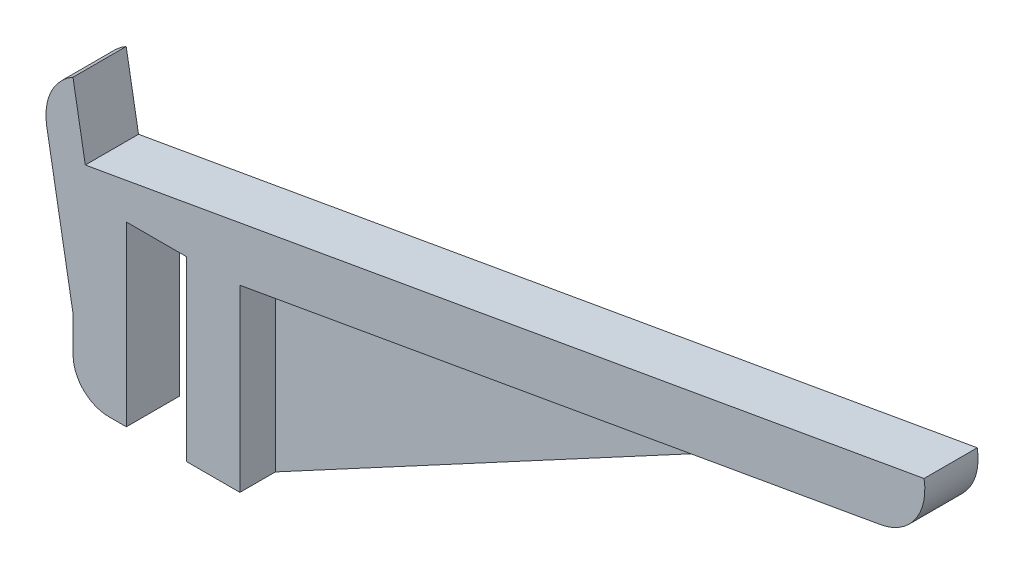
ISO-10303-21;
HEADER;
FILE_DESCRIPTION(('STEP AP214'),'2;1');
FILE_NAME('part.step','',(''),(''),'','','');
FILE_SCHEMA(('AUTOMOTIVE_DESIGN { 1 0 10303 214 1 1 1 1 }'));
ENDSEC;
DATA;
#1=APPLICATION_CONTEXT('core data for automotive mechanical design processes');
#2=APPLICATION_PROTOCOL_DEFINITION('international standard','automotive_design',2000,#1);
#3=PRODUCT_CONTEXT('',#1,'mechanical');
#4=PRODUCT('Part','Part','',(#3));
#5=PRODUCT_RELATED_PRODUCT_CATEGORY('part','',(#4));
#6=PRODUCT_DEFINITION_FORMATION('','',#4);
#7=PRODUCT_DEFINITION_CONTEXT('part definition',#1,'design');
#8=PRODUCT_DEFINITION('design','',#6,#7);
#9=PRODUCT_DEFINITION_SHAPE('','',#8);
#10=(LENGTH_UNIT() NAMED_UNIT(*) SI_UNIT(.MILLI.,.METRE.));
#11=(NAMED_UNIT(*) PLANE_ANGLE_UNIT() SI_UNIT($,.RADIAN.));
#12=(NAMED_UNIT(*) SI_UNIT($,.STERADIAN.) SOLID_ANGLE_UNIT());
#13=UNCERTAINTY_MEASURE_WITH_UNIT(LENGTH_MEASURE(1.E-05),#10,'distance_accuracy_value','');
#14=(GEOMETRIC_REPRESENTATION_CONTEXT(3) GLOBAL_UNCERTAINTY_ASSIGNED_CONTEXT((#13)) GLOBAL_UNIT_ASSIGNED_CONTEXT((#10,
#11,#12)) REPRESENTATION_CONTEXT('',''));
#15=CARTESIAN_POINT('',(0.,0.,0.));
#16=DIRECTION('',(0.,0.,1.));
#17=DIRECTION('',(1.,0.,0.));
#18=AXIS2_PLACEMENT_3D('',#15,#16,#17);
#19=CARTESIAN_POINT('',(15.,-50.,15.));
#20=DIRECTION('',(-1.,0.,0.));
#21=DIRECTION('',(0.,0.,1.));
#22=AXIS2_PLACEMENT_3D('',#19,#20,#21);
#23=PLANE('',#22);
#24=DIRECTION('',(0.,-1.,0.));
#25=VECTOR('',#24,1.);
#26=CARTESIAN_POINT('',(15.,0.5653303232422,5.));
#27=LINE('',#26,#25);
#28=CARTESIAN_POINT('',(15.,0.5653303232422,5.));
#29=VERTEX_POINT('',#28);
#30=CARTESIAN_POINT('',(15.,-50.,5.));
#31=VERTEX_POINT('',#30);
#32=EDGE_CURVE('E166',#29,#31,#27,.T.);
#33=ORIENTED_EDGE('',*,*,#32,.F.);
#34=DIRECTION('',(0.,0.,-1.));
#35=VECTOR('',#34,1.);
#36=CARTESIAN_POINT('',(15.,0.5653303232422,15.));
#37=LINE('',#36,#35);
#38=CARTESIAN_POINT('',(15.,0.5653303232422,15.));
#39=VERTEX_POINT('',#38);
#40=EDGE_CURVE('E236',#39,#29,#37,.T.);
#41=ORIENTED_EDGE('',*,*,#40,.F.);
#42=DIRECTION('',(0.,1.,0.));
#43=VECTOR('',#42,1.);
#44=CARTESIAN_POINT('',(15.,-50.,15.));
#45=LINE('',#44,#43);
#46=CARTESIAN_POINT('',(15.,-50.,15.));
#47=VERTEX_POINT('',#46);
#48=EDGE_CURVE('E184',#47,#39,#45,.T.);
#49=ORIENTED_EDGE('',*,*,#48,.F.);
#50=DIRECTION('',(0.,0.,-1.));
#51=VECTOR('',#50,1.);
#52=CARTESIAN_POINT('',(15.,-50.,15.));
#53=LINE('',#52,#51);
#54=EDGE_CURVE('E238',#47,#31,#53,.T.);
#55=ORIENTED_EDGE('',*,*,#54,.T.);
#56=EDGE_LOOP('',(#33,#41,#49,#55));
#57=FACE_BOUND('',#56,.T.);
#58=ADVANCED_FACE('F37',(#57),#23,.F.);
#59=CARTESIAN_POINT('',(15.,0.5653303232422,15.));
#60=DIRECTION('',(-0.173648177666932,0.984807753012208,0.));
#61=DIRECTION('',(-0.984807753012208,-0.173648177666932,0.));
#62=AXIS2_PLACEMENT_3D('',#59,#60,#61);
#63=PLANE('',#62);
#64=DIRECTION('',(0.984807753012208,0.173648177666932,0.));
#65=VECTOR('',#64,1.);
#66=CARTESIAN_POINT('',(15.,0.5653303232422,0.));
#67=LINE('',#66,#65);
#68=CARTESIAN_POINT('',(154.906481174219,25.2346177302382,0.));
#69=VERTEX_POINT('',#68);
#70=CARTESIAN_POINT('',(195.620066040424,32.413521223514,0.));
#71=VERTEX_POINT('',#70);
#72=EDGE_CURVE('E144',#69,#71,#67,.T.);
#73=ORIENTED_EDGE('',*,*,#72,.T.);
#74=DIRECTION('',(0.,0.,-1.));
#75=VECTOR('',#74,1.);
#76=CARTESIAN_POINT('',(195.620066040424,32.413521223514,15.));
#77=LINE('',#76,#75);
#78=CARTESIAN_POINT('',(195.620066040424,32.413521223514,15.));
#79=VERTEX_POINT('',#78);
#80=EDGE_CURVE('E45',#71,#79,#77,.F.);
#81=ORIENTED_EDGE('',*,*,#80,.T.);
#82=DIRECTION('',(0.984807753012208,0.173648177666932,0.));
#83=VECTOR('',#82,1.);
#84=CARTESIAN_POINT('',(15.,0.5653303232422,15.));
#85=LINE('',#84,#83);
#86=EDGE_CURVE('E186',#39,#79,#85,.T.);
#87=ORIENTED_EDGE('',*,*,#86,.F.);
#88=ORIENTED_EDGE('',*,*,#40,.T.);
#89=DIRECTION('',(-0.984807753012208,-0.173648177666932,0.));
#90=VECTOR('',#89,1.);
#91=CARTESIAN_POINT('',(154.906481174219,25.2346177302382,5.));
#92=LINE('',#91,#90);
#93=CARTESIAN_POINT('',(154.906481174219,25.2346177302382,5.));
#94=VERTEX_POINT('',#93);
#95=EDGE_CURVE('E159',#94,#29,#92,.T.);
#96=ORIENTED_EDGE('',*,*,#95,.F.);
#97=DIRECTION('',(0.,0.,-1.));
#98=VECTOR('',#97,1.);
#99=CARTESIAN_POINT('',(154.906481174219,25.2346177302382,5.));
#100=LINE('',#99,#98);
#101=EDGE_CURVE('E155',#94,#69,#100,.T.);
#102=ORIENTED_EDGE('',*,*,#101,.T.);
#103=EDGE_LOOP('',(#73,#81,#87,#88,#96,#102));
#104=FACE_BOUND('',#103,.T.);
#105=ADVANCED_FACE('F156',(#104),#63,.F.);
#106=CARTESIAN_POINT('',(0.,0.,15.));
#107=DIRECTION('',(0.,1.,0.));
#108=DIRECTION('',(0.,0.,1.));
#109=AXIS2_PLACEMENT_3D('',#106,#107,#108);
#110=PLANE('',#109);
#111=DIRECTION('',(1.,0.,0.));
#112=VECTOR('',#111,1.);
#113=CARTESIAN_POINT('',(0.,0.,0.));
#114=LINE('',#113,#112);
#115=CARTESIAN_POINT('',(-17.,0.,0.));
#116=VERTEX_POINT('',#115);
#117=CARTESIAN_POINT('',(0.,0.,0.));
#118=VERTEX_POINT('',#117);
#119=EDGE_CURVE('E175',#116,#118,#114,.T.);
#120=ORIENTED_EDGE('',*,*,#119,.T.);
#121=DIRECTION('',(0.,0.,-1.));
#122=VECTOR('',#121,1.);
#123=CARTESIAN_POINT('',(0.,0.,15.));
#124=LINE('',#123,#122);
#125=CARTESIAN_POINT('',(0.,0.,15.));
#126=VERTEX_POINT('',#125);
#127=EDGE_CURVE('E244',#126,#118,#124,.T.);
#128=ORIENTED_EDGE('',*,*,#127,.F.);
#129=DIRECTION('',(1.,0.,0.));
#130=VECTOR('',#129,1.);
#131=CARTESIAN_POINT('',(0.,0.,15.));
#132=LINE('',#131,#130);
#133=CARTESIAN_POINT('',(-17.,0.,15.));
#134=VERTEX_POINT('',#133);
#135=EDGE_CURVE('E176',#134,#126,#132,.T.);
#136=ORIENTED_EDGE('',*,*,#135,.F.);
#137=DIRECTION('',(0.,0.,-1.));
#138=VECTOR('',#137,1.);
#139=CARTESIAN_POINT('',(-17.,0.,15.));
#140=LINE('',#139,#138);
#141=EDGE_CURVE('E201',#134,#116,#140,.T.);
#142=ORIENTED_EDGE('',*,*,#141,.T.);
#143=EDGE_LOOP('',(#120,#128,#136,#142));
#144=FACE_BOUND('',#143,.T.);
#145=ADVANCED_FACE('F312',(#144),#110,.F.);
#146=CARTESIAN_POINT('',(0.,0.,15.));
#147=DIRECTION('',(1.,0.,0.));
#148=DIRECTION('',(0.,1.,0.));
#149=AXIS2_PLACEMENT_3D('',#146,#147,#148);
#150=PLANE('',#149);
#151=DIRECTION('',(0.,-1.,0.));
#152=VECTOR('',#151,1.);
#153=CARTESIAN_POINT('',(0.,0.,0.));
#154=LINE('',#153,#152);
#155=CARTESIAN_POINT('',(0.,-50.,0.));
#156=VERTEX_POINT('',#155);
#157=EDGE_CURVE('E204',#118,#156,#154,.T.);
#158=ORIENTED_EDGE('',*,*,#157,.T.);
#159=DIRECTION('',(0.,0.,-1.));
#160=VECTOR('',#159,1.);
#161=CARTESIAN_POINT('',(0.,-50.,15.));
#162=LINE('',#161,#160);
#163=CARTESIAN_POINT('',(0.,-50.,15.));
#164=VERTEX_POINT('',#163);
#165=EDGE_CURVE('E241',#164,#156,#162,.T.);
#166=ORIENTED_EDGE('',*,*,#165,.F.);
#167=DIRECTION('',(0.,-1.,0.));
#168=VECTOR('',#167,1.);
#169=CARTESIAN_POINT('',(0.,0.,15.));
#170=LINE('',#169,#168);
#171=EDGE_CURVE('E179',#126,#164,#170,.T.);
#172=ORIENTED_EDGE('',*,*,#171,.F.);
#173=ORIENTED_EDGE('',*,*,#127,.T.);
#174=EDGE_LOOP('',(#158,#166,#172,#173));
#175=FACE_BOUND('',#174,.T.);
#176=ADVANCED_FACE('F319',(#175),#150,.F.);
#177=CARTESIAN_POINT('',(0.,-50.,15.));
#178=DIRECTION('',(0.,1.,0.));
#179=DIRECTION('',(0.,0.,1.));
#180=AXIS2_PLACEMENT_3D('',#177,#178,#179);
#181=PLANE('',#180);
#182=DIRECTION('',(1.,0.,0.));
#183=VECTOR('',#182,1.);
#184=CARTESIAN_POINT('',(0.,-50.,0.));
#185=LINE('',#184,#183);
#186=CARTESIAN_POINT('',(15.,-50.,0.));
#187=VERTEX_POINT('',#186);
#188=EDGE_CURVE('E152',#156,#187,#185,.T.);
#189=ORIENTED_EDGE('',*,*,#188,.T.);
#190=DIRECTION('',(0.,0.,-1.));
#191=VECTOR('',#190,1.);
#192=CARTESIAN_POINT('',(15.,-50.,5.));
#193=LINE('',#192,#191);
#194=EDGE_CURVE('E163',#31,#187,#193,.T.);
#195=ORIENTED_EDGE('',*,*,#194,.F.);
#196=ORIENTED_EDGE('',*,*,#54,.F.);
#197=DIRECTION('',(1.,0.,0.));
#198=VECTOR('',#197,1.);
#199=CARTESIAN_POINT('',(0.,-50.,15.));
#200=LINE('',#199,#198);
#201=EDGE_CURVE('E182',#164,#47,#200,.T.);
#202=ORIENTED_EDGE('',*,*,#201,.F.);
#203=ORIENTED_EDGE('',*,*,#165,.T.);
#204=EDGE_LOOP('',(#189,#195,#196,#202,#203));
#205=FACE_BOUND('',#204,.T.);
#206=ADVANCED_FACE('F316',(#205),#181,.F.);
#207=CARTESIAN_POINT('',(-28.5664010523266,8.11479754363747,15.));
#208=DIRECTION('',(0.173648177666932,-0.984807753012208,0.));
#209=DIRECTION('',(0.984807753012208,0.173648177666932,0.));
#210=AXIS2_PLACEMENT_3D('',#207,#208,#209);
#211=PLANE('',#210);
#212=DIRECTION('',(-0.984807753012208,-0.173648177666932,0.));
#213=VECTOR('',#212,1.);
#214=CARTESIAN_POINT('',(-28.5664010523266,8.11479754363747,0.));
#215=LINE('',#214,#213);
#216=CARTESIAN_POINT('',(207.787459670603,49.7903601837011,0.));
#217=VERTEX_POINT('',#216);
#218=CARTESIAN_POINT('',(-28.5664010523266,8.11479754363747,0.));
#219=VERTEX_POINT('',#218);
#220=EDGE_CURVE('E151',#217,#219,#215,.T.);
#221=ORIENTED_EDGE('',*,*,#220,.T.);
#222=DIRECTION('',(0.,0.,-1.));
#223=VECTOR('',#222,1.);
#224=CARTESIAN_POINT('',(-28.5664010523266,8.11479754363747,15.));
#225=LINE('',#224,#223);
#226=CARTESIAN_POINT('',(-28.5664010523266,8.11479754363747,15.));
#227=VERTEX_POINT('',#226);
#228=EDGE_CURVE('E230',#227,#219,#225,.T.);
#229=ORIENTED_EDGE('',*,*,#228,.F.);
#230=DIRECTION('',(-0.984807753012208,-0.173648177666932,0.));
#231=VECTOR('',#230,1.);
#232=CARTESIAN_POINT('',(-28.5664010523266,8.11479754363747,15.));
#233=LINE('',#232,#231);
#234=CARTESIAN_POINT('',(207.787459670603,49.7903601837011,15.));
#235=VERTEX_POINT('',#234);
#236=EDGE_CURVE('E188',#235,#227,#233,.T.);
#237=ORIENTED_EDGE('',*,*,#236,.F.);
#238=DIRECTION('',(0.,0.,-1.));
#239=VECTOR('',#238,1.);
#240=CARTESIAN_POINT('',(207.787459670603,49.7903601837011,15.));
#241=LINE('',#240,#239);
#242=EDGE_CURVE('E233',#235,#217,#241,.T.);
#243=ORIENTED_EDGE('',*,*,#242,.T.);
#244=EDGE_LOOP('',(#221,#229,#237,#243));
#245=FACE_BOUND('',#244,.T.);
#246=ADVANCED_FACE('F300',(#245),#211,.F.);
#247=CARTESIAN_POINT('',(-32.0393646056653,27.8109526038816,15.));
#248=DIRECTION('',(-0.984807753012208,-0.173648177666931,0.));
#249=DIRECTION('',(0.173648177666931,-0.984807753012208,0.));
#250=AXIS2_PLACEMENT_3D('',#247,#248,#249);
#251=PLANE('',#250);
#252=DIRECTION('',(-0.173648177666931,0.984807753012208,0.));
#253=VECTOR('',#252,1.);
#254=CARTESIAN_POINT('',(-32.0393646056653,27.8109526038816,0.));
#255=LINE('',#254,#253);
#256=CARTESIAN_POINT('',(-32.0393646056653,27.8109526038816,0.));
#257=VERTEX_POINT('',#256);
#258=EDGE_CURVE('E208',#219,#257,#255,.T.);
#259=ORIENTED_EDGE('',*,*,#258,.T.);
#260=DIRECTION('',(0.,0.,-1.));
#261=VECTOR('',#260,1.);
#262=CARTESIAN_POINT('',(-32.0393646056653,27.8109526038816,15.));
#263=LINE('',#262,#261);
#264=CARTESIAN_POINT('',(-32.0393646056653,27.8109526038816,15.));
#265=VERTEX_POINT('',#264);
#266=EDGE_CURVE('E227',#265,#257,#263,.T.);
#267=ORIENTED_EDGE('',*,*,#266,.F.);
#268=DIRECTION('',(-0.173648177666931,0.984807753012208,0.));
#269=VECTOR('',#268,1.);
#270=CARTESIAN_POINT('',(-32.0393646056653,27.8109526038816,15.));
#271=LINE('',#270,#269);
#272=EDGE_CURVE('E190',#227,#265,#271,.T.);
#273=ORIENTED_EDGE('',*,*,#272,.F.);
#274=ORIENTED_EDGE('',*,*,#228,.T.);
#275=EDGE_LOOP('',(#259,#267,#273,#274));
#276=FACE_BOUND('',#275,.T.);
#277=ADVANCED_FACE('F291',(#276),#251,.F.);
#278=CARTESIAN_POINT('',(-32.,-30.,15.));
#279=DIRECTION('',(0.984807753012208,0.173648177666932,0.));
#280=DIRECTION('',(-0.173648177666932,0.984807753012208,0.));
#281=AXIS2_PLACEMENT_3D('',#278,#279,#280);
#282=PLANE('',#281);
#283=DIRECTION('',(0.173648177666932,-0.984807753012208,0.));
#284=VECTOR('',#283,1.);
#285=CARTESIAN_POINT('',(-32.,-30.,15.));
#286=LINE('',#285,#284);
#287=CARTESIAN_POINT('',(-39.4316860564078,12.1471860208119,15.));
#288=VERTEX_POINT('',#287);
#289=CARTESIAN_POINT('',(-32.,-30.,15.));
#290=VERTEX_POINT('',#289);
#291=EDGE_CURVE('E192',#288,#290,#286,.T.);
#292=ORIENTED_EDGE('',*,*,#291,.F.);
#293=DIRECTION('',(0.,0.,-1.));
#294=VECTOR('',#293,1.);
#295=CARTESIAN_POINT('',(-39.4316860564078,12.1471860208119,15.));
#296=LINE('',#295,#294);
#297=CARTESIAN_POINT('',(-39.4316860564078,12.1471860208119,0.));
#298=VERTEX_POINT('',#297);
#299=EDGE_CURVE('E247',#288,#298,#296,.T.);
#300=ORIENTED_EDGE('',*,*,#299,.T.);
#301=DIRECTION('',(0.173648177666932,-0.984807753012208,0.));
#302=VECTOR('',#301,1.);
#303=CARTESIAN_POINT('',(-32.,-30.,0.));
#304=LINE('',#303,#302);
#305=CARTESIAN_POINT('',(-32.,-30.,0.));
#306=VERTEX_POINT('',#305);
#307=EDGE_CURVE('E211',#298,#306,#304,.T.);
#308=ORIENTED_EDGE('',*,*,#307,.T.);
#309=DIRECTION('',(0.,0.,-1.));
#310=VECTOR('',#309,1.);
#311=CARTESIAN_POINT('',(-32.,-30.,15.));
#312=LINE('',#311,#310);
#313=EDGE_CURVE('E224',#290,#306,#312,.T.);
#314=ORIENTED_EDGE('',*,*,#313,.F.);
#315=EDGE_LOOP('',(#292,#300,#308,#314));
#316=FACE_BOUND('',#315,.T.);
#317=ADVANCED_FACE('F285',(#316),#282,.F.);
#318=CARTESIAN_POINT('',(-32.,-50.,15.));
#319=DIRECTION('',(1.,0.,0.));
#320=DIRECTION('',(0.,0.,-1.));
#321=AXIS2_PLACEMENT_3D('',#318,#319,#320);
#322=PLANE('',#321);
#323=DIRECTION('',(0.,-1.,0.));
#324=VECTOR('',#323,1.);
#325=CARTESIAN_POINT('',(-32.,-50.,0.));
#326=LINE('',#325,#324);
#327=CARTESIAN_POINT('',(-32.,-40.,0.));
#328=VERTEX_POINT('',#327);
#329=EDGE_CURVE('E213',#306,#328,#326,.T.);
#330=ORIENTED_EDGE('',*,*,#329,.T.);
#331=DIRECTION('',(0.,0.,-1.));
#332=VECTOR('',#331,1.);
#333=CARTESIAN_POINT('',(-32.,-40.,15.));
#334=LINE('',#333,#332);
#335=CARTESIAN_POINT('',(-32.,-40.,15.));
#336=VERTEX_POINT('',#335);
#337=EDGE_CURVE('E259',#328,#336,#334,.F.);
#338=ORIENTED_EDGE('',*,*,#337,.T.);
#339=DIRECTION('',(0.,-1.,0.));
#340=VECTOR('',#339,1.);
#341=CARTESIAN_POINT('',(-32.,-50.,15.));
#342=LINE('',#341,#340);
#343=EDGE_CURVE('E194',#290,#336,#342,.T.);
#344=ORIENTED_EDGE('',*,*,#343,.F.);
#345=ORIENTED_EDGE('',*,*,#313,.T.);
#346=EDGE_LOOP('',(#330,#338,#344,#345));
#347=FACE_BOUND('',#346,.T.);
#348=ADVANCED_FACE('F281',(#347),#322,.F.);
#349=CARTESIAN_POINT('',(-17.,-50.,15.));
#350=DIRECTION('',(0.,1.,0.));
#351=DIRECTION('',(-1.,0.,0.));
#352=AXIS2_PLACEMENT_3D('',#349,#350,#351);
#353=PLANE('',#352);
#354=DIRECTION('',(1.,0.,0.));
#355=VECTOR('',#354,1.);
#356=CARTESIAN_POINT('',(-17.,-50.,15.));
#357=LINE('',#356,#355);
#358=CARTESIAN_POINT('',(-22.,-50.,15.));
#359=VERTEX_POINT('',#358);
#360=CARTESIAN_POINT('',(-17.,-50.,15.));
#361=VERTEX_POINT('',#360);
#362=EDGE_CURVE('E197',#359,#361,#357,.T.);
#363=ORIENTED_EDGE('',*,*,#362,.F.);
#364=DIRECTION('',(0.,0.,-1.));
#365=VECTOR('',#364,1.);
#366=CARTESIAN_POINT('',(-22.,-50.,15.));
#367=LINE('',#366,#365);
#368=CARTESIAN_POINT('',(-22.,-50.,0.));
#369=VERTEX_POINT('',#368);
#370=EDGE_CURVE('E254',#359,#369,#367,.T.);
#371=ORIENTED_EDGE('',*,*,#370,.T.);
#372=DIRECTION('',(1.,0.,0.));
#373=VECTOR('',#372,1.);
#374=CARTESIAN_POINT('',(-17.,-50.,0.));
#375=LINE('',#374,#373);
#376=CARTESIAN_POINT('',(-17.,-50.,0.));
#377=VERTEX_POINT('',#376);
#378=EDGE_CURVE('E216',#369,#377,#375,.T.);
#379=ORIENTED_EDGE('',*,*,#378,.T.);
#380=DIRECTION('',(0.,0.,-1.));
#381=VECTOR('',#380,1.);
#382=CARTESIAN_POINT('',(-17.,-50.,15.));
#383=LINE('',#382,#381);
#384=EDGE_CURVE('E221',#361,#377,#383,.T.);
#385=ORIENTED_EDGE('',*,*,#384,.F.);
#386=EDGE_LOOP('',(#363,#371,#379,#385));
#387=FACE_BOUND('',#386,.T.);
#388=ADVANCED_FACE('F273',(#387),#353,.F.);
#389=CARTESIAN_POINT('',(-17.,0.,15.));
#390=DIRECTION('',(-1.,0.,0.));
#391=DIRECTION('',(0.,-1.,0.));
#392=AXIS2_PLACEMENT_3D('',#389,#390,#391);
#393=PLANE('',#392);
#394=DIRECTION('',(0.,1.,0.));
#395=VECTOR('',#394,1.);
#396=CARTESIAN_POINT('',(-17.,0.,0.));
#397=LINE('',#396,#395);
#398=EDGE_CURVE('E180',#377,#116,#397,.T.);
#399=ORIENTED_EDGE('',*,*,#398,.T.);
#400=ORIENTED_EDGE('',*,*,#141,.F.);
#401=DIRECTION('',(0.,1.,0.));
#402=VECTOR('',#401,1.);
#403=CARTESIAN_POINT('',(-17.,0.,15.));
#404=LINE('',#403,#402);
#405=EDGE_CURVE('E199',#361,#134,#404,.T.);
#406=ORIENTED_EDGE('',*,*,#405,.F.);
#407=ORIENTED_EDGE('',*,*,#384,.T.);
#408=EDGE_LOOP('',(#399,#400,#406,#407));
#409=FACE_BOUND('',#408,.T.);
#410=ADVANCED_FACE('F341',(#409),#393,.F.);
#411=CARTESIAN_POINT('',(0.,0.,15.));
#412=DIRECTION('',(0.,0.,1.));
#413=DIRECTION('',(1.,0.,0.));
#414=AXIS2_PLACEMENT_3D('',#411,#412,#413);
#415=PLANE('',#414);
#416=ORIENTED_EDGE('',*,*,#86,.T.);
#417=CARTESIAN_POINT('',(193.01534337542,47.1856375186972,15.));
#418=DIRECTION('',(0.,0.,1.));
#419=DIRECTION('',(1.,0.,0.));
#420=AXIS2_PLACEMENT_3D('',#417,#418,#419);
#421=CIRCLE('',#420,15.);
#422=EDGE_CURVE('E11',#79,#235,#421,.T.);
#423=ORIENTED_EDGE('',*,*,#422,.T.);
#424=ORIENTED_EDGE('',*,*,#236,.T.);
#425=ORIENTED_EDGE('',*,*,#272,.T.);
#426=CARTESIAN_POINT('',(-24.6595697612247,14.7519086858159,15.));
#427=DIRECTION('',(0.,0.,1.));
#428=DIRECTION('',(1.,0.,0.));
#429=AXIS2_PLACEMENT_3D('',#426,#427,#428);
#430=CIRCLE('',#429,15.);
#431=EDGE_CURVE('E252',#265,#288,#430,.T.);
#432=ORIENTED_EDGE('',*,*,#431,.T.);
#433=ORIENTED_EDGE('',*,*,#291,.T.);
#434=ORIENTED_EDGE('',*,*,#343,.T.);
#435=CARTESIAN_POINT('',(-22.,-40.,15.));
#436=DIRECTION('',(0.,0.,1.));
#437=DIRECTION('',(1.,0.,0.));
#438=AXIS2_PLACEMENT_3D('',#435,#436,#437);
#439=CIRCLE('',#438,10.);
#440=EDGE_CURVE('E261',#336,#359,#439,.T.);
#441=ORIENTED_EDGE('',*,*,#440,.T.);
#442=ORIENTED_EDGE('',*,*,#362,.T.);
#443=ORIENTED_EDGE('',*,*,#405,.T.);
#444=ORIENTED_EDGE('',*,*,#135,.T.);
#445=ORIENTED_EDGE('',*,*,#171,.T.);
#446=ORIENTED_EDGE('',*,*,#201,.T.);
#447=ORIENTED_EDGE('',*,*,#48,.T.);
#448=EDGE_LOOP('',(#416,#423,#424,#425,#432,#433,#434,#441,#442,#443,#444,#445,#446,#447));
#449=FACE_BOUND('',#448,.T.);
#450=ADVANCED_FACE('F266',(#449),#415,.T.);
#451=CARTESIAN_POINT('',(0.,0.,0.));
#452=DIRECTION('',(0.,0.,1.));
#453=DIRECTION('',(1.,0.,0.));
#454=AXIS2_PLACEMENT_3D('',#451,#452,#453);
#455=PLANE('',#454);
#456=ORIENTED_EDGE('',*,*,#220,.F.);
#457=CARTESIAN_POINT('',(193.01534337542,47.1856375186972,0.));
#458=DIRECTION('',(0.,0.,1.));
#459=DIRECTION('',(1.,0.,0.));
#460=AXIS2_PLACEMENT_3D('',#457,#458,#459);
#461=CIRCLE('',#460,15.);
#462=EDGE_CURVE('E59',#217,#71,#461,.F.);
#463=ORIENTED_EDGE('',*,*,#462,.T.);
#464=ORIENTED_EDGE('',*,*,#72,.F.);
#465=DIRECTION('',(0.880732802572609,0.473613482148258,0.));
#466=VECTOR('',#465,1.);
#467=CARTESIAN_POINT('',(15.,-50.,0.));
#468=LINE('',#467,#466);
#469=EDGE_CURVE('E149',#187,#69,#468,.T.);
#470=ORIENTED_EDGE('',*,*,#469,.F.);
#471=ORIENTED_EDGE('',*,*,#188,.F.);
#472=ORIENTED_EDGE('',*,*,#157,.F.);
#473=ORIENTED_EDGE('',*,*,#119,.F.);
#474=ORIENTED_EDGE('',*,*,#398,.F.);
#475=ORIENTED_EDGE('',*,*,#378,.F.);
#476=CARTESIAN_POINT('',(-22.,-40.,0.));
#477=DIRECTION('',(0.,0.,1.));
#478=DIRECTION('',(1.,0.,0.));
#479=AXIS2_PLACEMENT_3D('',#476,#477,#478);
#480=CIRCLE('',#479,10.);
#481=EDGE_CURVE('E257',#369,#328,#480,.F.);
#482=ORIENTED_EDGE('',*,*,#481,.T.);
#483=ORIENTED_EDGE('',*,*,#329,.F.);
#484=ORIENTED_EDGE('',*,*,#307,.F.);
#485=CARTESIAN_POINT('',(-24.6595697612247,14.7519086858159,0.));
#486=DIRECTION('',(0.,0.,1.));
#487=DIRECTION('',(1.,0.,0.));
#488=AXIS2_PLACEMENT_3D('',#485,#486,#487);
#489=CIRCLE('',#488,15.);
#490=EDGE_CURVE('E250',#298,#257,#489,.F.);
#491=ORIENTED_EDGE('',*,*,#490,.T.);
#492=ORIENTED_EDGE('',*,*,#258,.F.);
#493=EDGE_LOOP('',(#456,#463,#464,#470,#471,#472,#473,#474,#475,#482,#483,#484,#491,#492));
#494=FACE_BOUND('',#493,.T.);
#495=ADVANCED_FACE('F146',(#494),#455,.F.);
#496=CARTESIAN_POINT('',(15.,-50.,5.));
#497=DIRECTION('',(-0.473613482148258,0.880732802572609,0.));
#498=DIRECTION('',(-0.880732802572609,-0.473613482148258,0.));
#499=AXIS2_PLACEMENT_3D('',#496,#497,#498);
#500=PLANE('',#499);
#501=ORIENTED_EDGE('',*,*,#469,.T.);
#502=ORIENTED_EDGE('',*,*,#101,.F.);
#503=DIRECTION('',(0.880732802572609,0.473613482148258,0.));
#504=VECTOR('',#503,1.);
#505=CARTESIAN_POINT('',(15.,-50.,5.));
#506=LINE('',#505,#504);
#507=EDGE_CURVE('E169',#31,#94,#506,.T.);
#508=ORIENTED_EDGE('',*,*,#507,.F.);
#509=ORIENTED_EDGE('',*,*,#194,.T.);
#510=EDGE_LOOP('',(#501,#502,#508,#509));
#511=FACE_BOUND('',#510,.T.);
#512=ADVANCED_FACE('F165',(#511),#500,.F.);
#513=CARTESIAN_POINT('',(0.,0.,5.));
#514=DIRECTION('',(0.,0.,-1.));
#515=DIRECTION('',(-1.,0.,0.));
#516=AXIS2_PLACEMENT_3D('',#513,#514,#515);
#517=PLANE('',#516);
#518=ORIENTED_EDGE('',*,*,#32,.T.);
#519=ORIENTED_EDGE('',*,*,#507,.T.);
#520=ORIENTED_EDGE('',*,*,#95,.T.);
#521=EDGE_LOOP('',(#518,#519,#520));
#522=FACE_BOUND('',#521,.T.);
#523=ADVANCED_FACE('F328',(#522),#517,.F.);
#524=CARTESIAN_POINT('',(-24.6595697612247,14.7519086858159,15.));
#525=DIRECTION('',(0.,0.,-1.));
#526=DIRECTION('',(-1.,0.,0.));
#527=AXIS2_PLACEMENT_3D('',#524,#525,#526);
#528=CYLINDRICAL_SURFACE('',#527,15.);
#529=ORIENTED_EDGE('',*,*,#431,.F.);
#530=ORIENTED_EDGE('',*,*,#266,.T.);
#531=ORIENTED_EDGE('',*,*,#490,.F.);
#532=ORIENTED_EDGE('',*,*,#299,.F.);
#533=EDGE_LOOP('',(#529,#530,#531,#532));
#534=FACE_BOUND('',#533,.T.);
#535=ADVANCED_FACE('F295',(#534),#528,.T.);
#536=CARTESIAN_POINT('',(-22.,-40.,15.));
#537=DIRECTION('',(0.,0.,-1.));
#538=DIRECTION('',(-1.,0.,0.));
#539=AXIS2_PLACEMENT_3D('',#536,#537,#538);
#540=CYLINDRICAL_SURFACE('',#539,10.);
#541=ORIENTED_EDGE('',*,*,#440,.F.);
#542=ORIENTED_EDGE('',*,*,#337,.F.);
#543=ORIENTED_EDGE('',*,*,#481,.F.);
#544=ORIENTED_EDGE('',*,*,#370,.F.);
#545=EDGE_LOOP('',(#541,#542,#543,#544));
#546=FACE_BOUND('',#545,.T.);
#547=ADVANCED_FACE('F276',(#546),#540,.T.);
#548=CARTESIAN_POINT('',(193.01534337542,47.1856375186972,15.));
#549=DIRECTION('',(0.,0.,-1.));
#550=DIRECTION('',(-1.,0.,0.));
#551=AXIS2_PLACEMENT_3D('',#548,#549,#550);
#552=CYLINDRICAL_SURFACE('',#551,15.);
#553=ORIENTED_EDGE('',*,*,#422,.F.);
#554=ORIENTED_EDGE('',*,*,#80,.F.);
#555=ORIENTED_EDGE('',*,*,#462,.F.);
#556=ORIENTED_EDGE('',*,*,#242,.F.);
#557=EDGE_LOOP('',(#553,#554,#555,#556));
#558=FACE_BOUND('',#557,.T.);
#559=ADVANCED_FACE('F39',(#558),#552,.T.);
#560=CLOSED_SHELL('',(#58,#105,#145,#176,#206,#246,#277,#317,#348,#388,#410,#450,#495,#512,#523,
#535,#547,#559));
#561=MANIFOLD_SOLID_BREP('B2',#560);
#562=ADVANCED_BREP_SHAPE_REPRESENTATION('',(#18,#561),#14);
#563=SHAPE_DEFINITION_REPRESENTATION(#9,#562);
ENDSEC;
END-ISO-10303-21;
